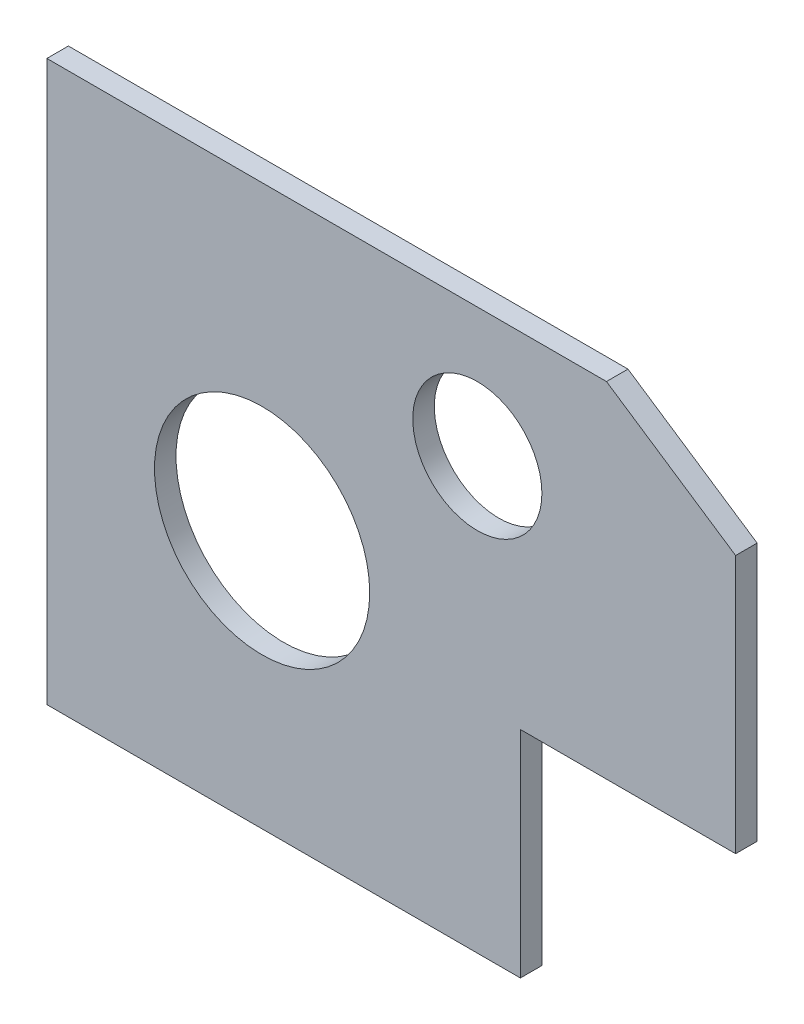
ISO-10303-21;
HEADER;
FILE_DESCRIPTION(('STEP AP214'),'2;1');
FILE_NAME('part.step','',(''),(''),'','','');
FILE_SCHEMA(('AUTOMOTIVE_DESIGN { 1 0 10303 214 1 1 1 1 }'));
ENDSEC;
DATA;
#1=APPLICATION_CONTEXT('core data for automotive mechanical design processes');
#2=APPLICATION_PROTOCOL_DEFINITION('international standard','automotive_design',2000,#1);
#3=PRODUCT_CONTEXT('',#1,'mechanical');
#4=PRODUCT('Part','Part','',(#3));
#5=PRODUCT_RELATED_PRODUCT_CATEGORY('part','',(#4));
#6=PRODUCT_DEFINITION_FORMATION('','',#4);
#7=PRODUCT_DEFINITION_CONTEXT('part definition',#1,'design');
#8=PRODUCT_DEFINITION('design','',#6,#7);
#9=PRODUCT_DEFINITION_SHAPE('','',#8);
#10=(LENGTH_UNIT() NAMED_UNIT(*) SI_UNIT(.MILLI.,.METRE.));
#11=(NAMED_UNIT(*) PLANE_ANGLE_UNIT() SI_UNIT($,.RADIAN.));
#12=(NAMED_UNIT(*) SI_UNIT($,.STERADIAN.) SOLID_ANGLE_UNIT());
#13=UNCERTAINTY_MEASURE_WITH_UNIT(LENGTH_MEASURE(1.E-05),#10,'distance_accuracy_value','');
#14=(GEOMETRIC_REPRESENTATION_CONTEXT(3) GLOBAL_UNCERTAINTY_ASSIGNED_CONTEXT((#13)) GLOBAL_UNIT_ASSIGNED_CONTEXT((#10,
#11,#12)) REPRESENTATION_CONTEXT('',''));
#15=CARTESIAN_POINT('',(0.,0.,0.));
#16=DIRECTION('',(0.,0.,1.));
#17=DIRECTION('',(1.,0.,0.));
#18=AXIS2_PLACEMENT_3D('',#15,#16,#17);
#19=CARTESIAN_POINT('',(0.,0.,6.35));
#20=DIRECTION('',(0.,0.,-1.));
#21=DIRECTION('',(-1.,0.,0.));
#22=AXIS2_PLACEMENT_3D('',#19,#20,#21);
#23=PLANE('',#22);
#24=DIRECTION('',(0.,1.,0.));
#25=VECTOR('',#24,1.);
#26=CARTESIAN_POINT('',(0.,139.7,6.35));
#27=LINE('',#26,#25);
#28=CARTESIAN_POINT('',(0.,63.5,6.35));
#29=VERTEX_POINT('',#28);
#30=CARTESIAN_POINT('',(0.,139.7,6.35));
#31=VERTEX_POINT('',#30);
#32=EDGE_CURVE('E137',#29,#31,#27,.T.);
#33=ORIENTED_EDGE('',*,*,#32,.T.);
#34=DIRECTION('',(-0.832050294337867,0.554700196225195,0.));
#35=VECTOR('',#34,1.);
#36=CARTESIAN_POINT('',(-38.1000000000034,165.1,6.35));
#37=LINE('',#36,#35);
#38=CARTESIAN_POINT('',(-38.1000000000034,165.1,6.35));
#39=VERTEX_POINT('',#38);
#40=EDGE_CURVE('E90',#31,#39,#37,.T.);
#41=ORIENTED_EDGE('',*,*,#40,.T.);
#42=DIRECTION('',(-1.,0.,0.));
#43=VECTOR('',#42,1.);
#44=CARTESIAN_POINT('',(-203.200000000003,165.1,6.35));
#45=LINE('',#44,#43);
#46=CARTESIAN_POINT('',(-203.200000000003,165.1,6.35));
#47=VERTEX_POINT('',#46);
#48=EDGE_CURVE('E149',#39,#47,#45,.T.);
#49=ORIENTED_EDGE('',*,*,#48,.T.);
#50=DIRECTION('',(0.,-1.,0.));
#51=VECTOR('',#50,1.);
#52=CARTESIAN_POINT('',(-203.2,0.,6.35));
#53=LINE('',#52,#51);
#54=CARTESIAN_POINT('',(-203.2,0.,6.35));
#55=VERTEX_POINT('',#54);
#56=EDGE_CURVE('E106',#47,#55,#53,.T.);
#57=ORIENTED_EDGE('',*,*,#56,.T.);
#58=DIRECTION('',(1.,0.,0.));
#59=VECTOR('',#58,1.);
#60=CARTESIAN_POINT('',(-63.5,0.,6.35));
#61=LINE('',#60,#59);
#62=CARTESIAN_POINT('',(-63.5,0.,6.35));
#63=VERTEX_POINT('',#62);
#64=EDGE_CURVE('E100',#55,#63,#61,.T.);
#65=ORIENTED_EDGE('',*,*,#64,.T.);
#66=DIRECTION('',(0.,1.,0.));
#67=VECTOR('',#66,1.);
#68=CARTESIAN_POINT('',(-63.5,63.5,6.35));
#69=LINE('',#68,#67);
#70=CARTESIAN_POINT('',(-63.5,63.5,6.35));
#71=VERTEX_POINT('',#70);
#72=EDGE_CURVE('E104',#63,#71,#69,.T.);
#73=ORIENTED_EDGE('',*,*,#72,.T.);
#74=DIRECTION('',(1.,0.,0.));
#75=VECTOR('',#74,1.);
#76=CARTESIAN_POINT('',(0.,63.5,6.35));
#77=LINE('',#76,#75);
#78=EDGE_CURVE('E50',#71,#29,#77,.T.);
#79=ORIENTED_EDGE('',*,*,#78,.T.);
#80=EDGE_LOOP('',(#33,#41,#49,#57,#65,#73,#79));
#81=FACE_BOUND('',#80,.T.);
#82=CARTESIAN_POINT('',(-76.2000000000034,127.,6.35));
#83=DIRECTION('',(0.,0.,1.));
#84=DIRECTION('',(1.,0.,0.));
#85=AXIS2_PLACEMENT_3D('',#82,#83,#84);
#86=CIRCLE('',#85,19.0500000000033);
#87=CARTESIAN_POINT('',(-57.1500000000001,127.,6.35));
#88=VERTEX_POINT('',#87);
#89=EDGE_CURVE('E128',#88,#88,#86,.T.);
#90=ORIENTED_EDGE('',*,*,#89,.F.);
#91=EDGE_LOOP('',(#90));
#92=FACE_BOUND('',#91,.T.);
#93=CARTESIAN_POINT('',(-139.7,76.2,6.35));
#94=DIRECTION('',(0.,0.,1.));
#95=DIRECTION('',(1.,0.,0.));
#96=AXIS2_PLACEMENT_3D('',#93,#94,#95);
#97=CIRCLE('',#96,31.75);
#98=CARTESIAN_POINT('',(-107.95,76.2,6.35));
#99=VERTEX_POINT('',#98);
#100=EDGE_CURVE('E164',#99,#99,#97,.T.);
#101=ORIENTED_EDGE('',*,*,#100,.F.);
#102=EDGE_LOOP('',(#101));
#103=FACE_BOUND('',#102,.T.);
#104=ADVANCED_FACE('F33',(#81,#92,#103),#23,.F.);
#105=CARTESIAN_POINT('',(0.,0.,0.));
#106=DIRECTION('',(0.,0.,-1.));
#107=DIRECTION('',(-1.,0.,0.));
#108=AXIS2_PLACEMENT_3D('',#105,#106,#107);
#109=PLANE('',#108);
#110=CARTESIAN_POINT('',(-76.2000000000034,127.,0.));
#111=DIRECTION('',(0.,0.,1.));
#112=DIRECTION('',(1.,0.,0.));
#113=AXIS2_PLACEMENT_3D('',#110,#111,#112);
#114=CIRCLE('',#113,19.0500000000033);
#115=CARTESIAN_POINT('',(-57.1500000000001,127.,0.));
#116=VERTEX_POINT('',#115);
#117=EDGE_CURVE('E161',#116,#116,#114,.T.);
#118=ORIENTED_EDGE('',*,*,#117,.T.);
#119=EDGE_LOOP('',(#118));
#120=FACE_BOUND('',#119,.T.);
#121=DIRECTION('',(0.,1.,0.));
#122=VECTOR('',#121,1.);
#123=CARTESIAN_POINT('',(0.,139.7,0.));
#124=LINE('',#123,#122);
#125=CARTESIAN_POINT('',(0.,63.5,0.));
#126=VERTEX_POINT('',#125);
#127=CARTESIAN_POINT('',(0.,139.7,0.));
#128=VERTEX_POINT('',#127);
#129=EDGE_CURVE('E124',#126,#128,#124,.T.);
#130=ORIENTED_EDGE('',*,*,#129,.F.);
#131=DIRECTION('',(1.,0.,0.));
#132=VECTOR('',#131,1.);
#133=CARTESIAN_POINT('',(0.,63.5,0.));
#134=LINE('',#133,#132);
#135=CARTESIAN_POINT('',(-63.5,63.5,0.));
#136=VERTEX_POINT('',#135);
#137=EDGE_CURVE('E82',#136,#126,#134,.T.);
#138=ORIENTED_EDGE('',*,*,#137,.F.);
#139=DIRECTION('',(0.,1.,0.));
#140=VECTOR('',#139,1.);
#141=CARTESIAN_POINT('',(-63.5,63.5,0.));
#142=LINE('',#141,#140);
#143=CARTESIAN_POINT('',(-63.5,0.,0.));
#144=VERTEX_POINT('',#143);
#145=EDGE_CURVE('E76',#144,#136,#142,.T.);
#146=ORIENTED_EDGE('',*,*,#145,.F.);
#147=DIRECTION('',(1.,0.,0.));
#148=VECTOR('',#147,1.);
#149=CARTESIAN_POINT('',(-63.5,0.,0.));
#150=LINE('',#149,#148);
#151=CARTESIAN_POINT('',(-203.2,0.,0.));
#152=VERTEX_POINT('',#151);
#153=EDGE_CURVE('E114',#152,#144,#150,.T.);
#154=ORIENTED_EDGE('',*,*,#153,.F.);
#155=DIRECTION('',(0.,-1.,0.));
#156=VECTOR('',#155,1.);
#157=CARTESIAN_POINT('',(-203.2,0.,0.));
#158=LINE('',#157,#156);
#159=CARTESIAN_POINT('',(-203.200000000003,165.1,0.));
#160=VERTEX_POINT('',#159);
#161=EDGE_CURVE('E132',#160,#152,#158,.T.);
#162=ORIENTED_EDGE('',*,*,#161,.F.);
#163=DIRECTION('',(-1.,0.,0.));
#164=VECTOR('',#163,1.);
#165=CARTESIAN_POINT('',(-203.200000000003,165.1,0.));
#166=LINE('',#165,#164);
#167=CARTESIAN_POINT('',(-38.1000000000034,165.1,0.));
#168=VERTEX_POINT('',#167);
#169=EDGE_CURVE('E130',#168,#160,#166,.T.);
#170=ORIENTED_EDGE('',*,*,#169,.F.);
#171=DIRECTION('',(-0.832050294337867,0.554700196225195,0.));
#172=VECTOR('',#171,1.);
#173=CARTESIAN_POINT('',(-38.1000000000034,165.1,0.));
#174=LINE('',#173,#172);
#175=EDGE_CURVE('E127',#128,#168,#174,.T.);
#176=ORIENTED_EDGE('',*,*,#175,.F.);
#177=EDGE_LOOP('',(#130,#138,#146,#154,#162,#170,#176));
#178=FACE_BOUND('',#177,.T.);
#179=CARTESIAN_POINT('',(-139.7,76.2,0.));
#180=DIRECTION('',(0.,0.,1.));
#181=DIRECTION('',(1.,0.,0.));
#182=AXIS2_PLACEMENT_3D('',#179,#180,#181);
#183=CIRCLE('',#182,31.75);
#184=CARTESIAN_POINT('',(-107.95,76.2,0.));
#185=VERTEX_POINT('',#184);
#186=EDGE_CURVE('E167',#185,#185,#183,.T.);
#187=ORIENTED_EDGE('',*,*,#186,.T.);
#188=EDGE_LOOP('',(#187));
#189=FACE_BOUND('',#188,.T.);
#190=ADVANCED_FACE('F153',(#120,#178,#189),#109,.T.);
#191=CARTESIAN_POINT('',(0.,139.7,6.35));
#192=DIRECTION('',(-1.,0.,0.));
#193=DIRECTION('',(0.,-1.,0.));
#194=AXIS2_PLACEMENT_3D('',#191,#192,#193);
#195=PLANE('',#194);
#196=ORIENTED_EDGE('',*,*,#129,.T.);
#197=DIRECTION('',(0.,0.,-1.));
#198=VECTOR('',#197,1.);
#199=CARTESIAN_POINT('',(0.,139.7,6.35));
#200=LINE('',#199,#198);
#201=EDGE_CURVE('E11',#31,#128,#200,.T.);
#202=ORIENTED_EDGE('',*,*,#201,.F.);
#203=ORIENTED_EDGE('',*,*,#32,.F.);
#204=DIRECTION('',(0.,0.,-1.));
#205=VECTOR('',#204,1.);
#206=CARTESIAN_POINT('',(0.,63.5,6.35));
#207=LINE('',#206,#205);
#208=EDGE_CURVE('E120',#29,#126,#207,.T.);
#209=ORIENTED_EDGE('',*,*,#208,.T.);
#210=EDGE_LOOP('',(#196,#202,#203,#209));
#211=FACE_BOUND('',#210,.T.);
#212=ADVANCED_FACE('F35',(#211),#195,.F.);
#213=CARTESIAN_POINT('',(-38.1000000000034,165.1,6.35));
#214=DIRECTION('',(-0.554700196225194,-0.832050294337867,0.));
#215=DIRECTION('',(0.832050294337867,-0.554700196225195,0.));
#216=AXIS2_PLACEMENT_3D('',#213,#214,#215);
#217=PLANE('',#216);
#218=ORIENTED_EDGE('',*,*,#175,.T.);
#219=DIRECTION('',(0.,0.,-1.));
#220=VECTOR('',#219,1.);
#221=CARTESIAN_POINT('',(-38.1000000000034,165.1,6.35));
#222=LINE('',#221,#220);
#223=EDGE_CURVE('E42',#39,#168,#222,.T.);
#224=ORIENTED_EDGE('',*,*,#223,.F.);
#225=ORIENTED_EDGE('',*,*,#40,.F.);
#226=ORIENTED_EDGE('',*,*,#201,.T.);
#227=EDGE_LOOP('',(#218,#224,#225,#226));
#228=FACE_BOUND('',#227,.T.);
#229=ADVANCED_FACE('F197',(#228),#217,.F.);
#230=CARTESIAN_POINT('',(-203.200000000003,165.1,6.35));
#231=DIRECTION('',(0.,-1.,0.));
#232=DIRECTION('',(0.,0.,-1.));
#233=AXIS2_PLACEMENT_3D('',#230,#231,#232);
#234=PLANE('',#233);
#235=ORIENTED_EDGE('',*,*,#169,.T.);
#236=DIRECTION('',(0.,0.,-1.));
#237=VECTOR('',#236,1.);
#238=CARTESIAN_POINT('',(-203.200000000003,165.1,6.35));
#239=LINE('',#238,#237);
#240=EDGE_CURVE('E141',#47,#160,#239,.T.);
#241=ORIENTED_EDGE('',*,*,#240,.F.);
#242=ORIENTED_EDGE('',*,*,#48,.F.);
#243=ORIENTED_EDGE('',*,*,#223,.T.);
#244=EDGE_LOOP('',(#235,#241,#242,#243));
#245=FACE_BOUND('',#244,.T.);
#246=ADVANCED_FACE('F147',(#245),#234,.F.);
#247=CARTESIAN_POINT('',(-203.2,0.,6.35));
#248=DIRECTION('',(1.,0.,0.));
#249=DIRECTION('',(0.,1.,0.));
#250=AXIS2_PLACEMENT_3D('',#247,#248,#249);
#251=PLANE('',#250);
#252=ORIENTED_EDGE('',*,*,#161,.T.);
#253=DIRECTION('',(0.,0.,-1.));
#254=VECTOR('',#253,1.);
#255=CARTESIAN_POINT('',(-203.2,0.,6.35));
#256=LINE('',#255,#254);
#257=EDGE_CURVE('E115',#55,#152,#256,.T.);
#258=ORIENTED_EDGE('',*,*,#257,.F.);
#259=ORIENTED_EDGE('',*,*,#56,.F.);
#260=ORIENTED_EDGE('',*,*,#240,.T.);
#261=EDGE_LOOP('',(#252,#258,#259,#260));
#262=FACE_BOUND('',#261,.T.);
#263=ADVANCED_FACE('F156',(#262),#251,.F.);
#264=CARTESIAN_POINT('',(-63.5,0.,6.35));
#265=DIRECTION('',(0.,1.,0.));
#266=DIRECTION('',(-1.,0.,0.));
#267=AXIS2_PLACEMENT_3D('',#264,#265,#266);
#268=PLANE('',#267);
#269=ORIENTED_EDGE('',*,*,#153,.T.);
#270=DIRECTION('',(0.,0.,-1.));
#271=VECTOR('',#270,1.);
#272=CARTESIAN_POINT('',(-63.5,0.,6.35));
#273=LINE('',#272,#271);
#274=EDGE_CURVE('E111',#63,#144,#273,.T.);
#275=ORIENTED_EDGE('',*,*,#274,.F.);
#276=ORIENTED_EDGE('',*,*,#64,.F.);
#277=ORIENTED_EDGE('',*,*,#257,.T.);
#278=EDGE_LOOP('',(#269,#275,#276,#277));
#279=FACE_BOUND('',#278,.T.);
#280=ADVANCED_FACE('F112',(#279),#268,.F.);
#281=CARTESIAN_POINT('',(-63.5,63.5,6.35));
#282=DIRECTION('',(-1.,0.,0.));
#283=DIRECTION('',(0.,0.,1.));
#284=AXIS2_PLACEMENT_3D('',#281,#282,#283);
#285=PLANE('',#284);
#286=ORIENTED_EDGE('',*,*,#145,.T.);
#287=DIRECTION('',(0.,0.,-1.));
#288=VECTOR('',#287,1.);
#289=CARTESIAN_POINT('',(-63.5,63.5,6.35));
#290=LINE('',#289,#288);
#291=EDGE_CURVE('E116',#71,#136,#290,.T.);
#292=ORIENTED_EDGE('',*,*,#291,.F.);
#293=ORIENTED_EDGE('',*,*,#72,.F.);
#294=ORIENTED_EDGE('',*,*,#274,.T.);
#295=EDGE_LOOP('',(#286,#292,#293,#294));
#296=FACE_BOUND('',#295,.T.);
#297=ADVANCED_FACE('F118',(#296),#285,.F.);
#298=CARTESIAN_POINT('',(0.,63.5,6.35));
#299=DIRECTION('',(0.,1.,0.));
#300=DIRECTION('',(0.,0.,1.));
#301=AXIS2_PLACEMENT_3D('',#298,#299,#300);
#302=PLANE('',#301);
#303=ORIENTED_EDGE('',*,*,#137,.T.);
#304=ORIENTED_EDGE('',*,*,#208,.F.);
#305=ORIENTED_EDGE('',*,*,#78,.F.);
#306=ORIENTED_EDGE('',*,*,#291,.T.);
#307=EDGE_LOOP('',(#303,#304,#305,#306));
#308=FACE_BOUND('',#307,.T.);
#309=ADVANCED_FACE('F187',(#308),#302,.F.);
#310=CARTESIAN_POINT('',(-76.2000000000034,127.,6.35));
#311=DIRECTION('',(0.,0.,-1.));
#312=DIRECTION('',(-1.,0.,0.));
#313=AXIS2_PLACEMENT_3D('',#310,#311,#312);
#314=CYLINDRICAL_SURFACE('',#313,19.0500000000033);
#315=ORIENTED_EDGE('',*,*,#89,.T.);
#316=EDGE_LOOP('',(#315));
#317=FACE_BOUND('',#316,.T.);
#318=ORIENTED_EDGE('',*,*,#117,.F.);
#319=EDGE_LOOP('',(#318));
#320=FACE_BOUND('',#319,.T.);
#321=ADVANCED_FACE('F184',(#317,#320),#314,.F.);
#322=CARTESIAN_POINT('',(-139.7,76.2,6.35));
#323=DIRECTION('',(0.,0.,-1.));
#324=DIRECTION('',(-1.,0.,0.));
#325=AXIS2_PLACEMENT_3D('',#322,#323,#324);
#326=CYLINDRICAL_SURFACE('',#325,31.75);
#327=ORIENTED_EDGE('',*,*,#100,.T.);
#328=EDGE_LOOP('',(#327));
#329=FACE_BOUND('',#328,.T.);
#330=ORIENTED_EDGE('',*,*,#186,.F.);
#331=EDGE_LOOP('',(#330));
#332=FACE_BOUND('',#331,.T.);
#333=ADVANCED_FACE('F173',(#329,#332),#326,.F.);
#334=CLOSED_SHELL('',(#104,#190,#212,#229,#246,#263,#280,#297,#309,#321,#333));
#335=MANIFOLD_SOLID_BREP('B2',#334);
#336=ADVANCED_BREP_SHAPE_REPRESENTATION('',(#18,#335),#14);
#337=SHAPE_DEFINITION_REPRESENTATION(#9,#336);
ENDSEC;
END-ISO-10303-21;
